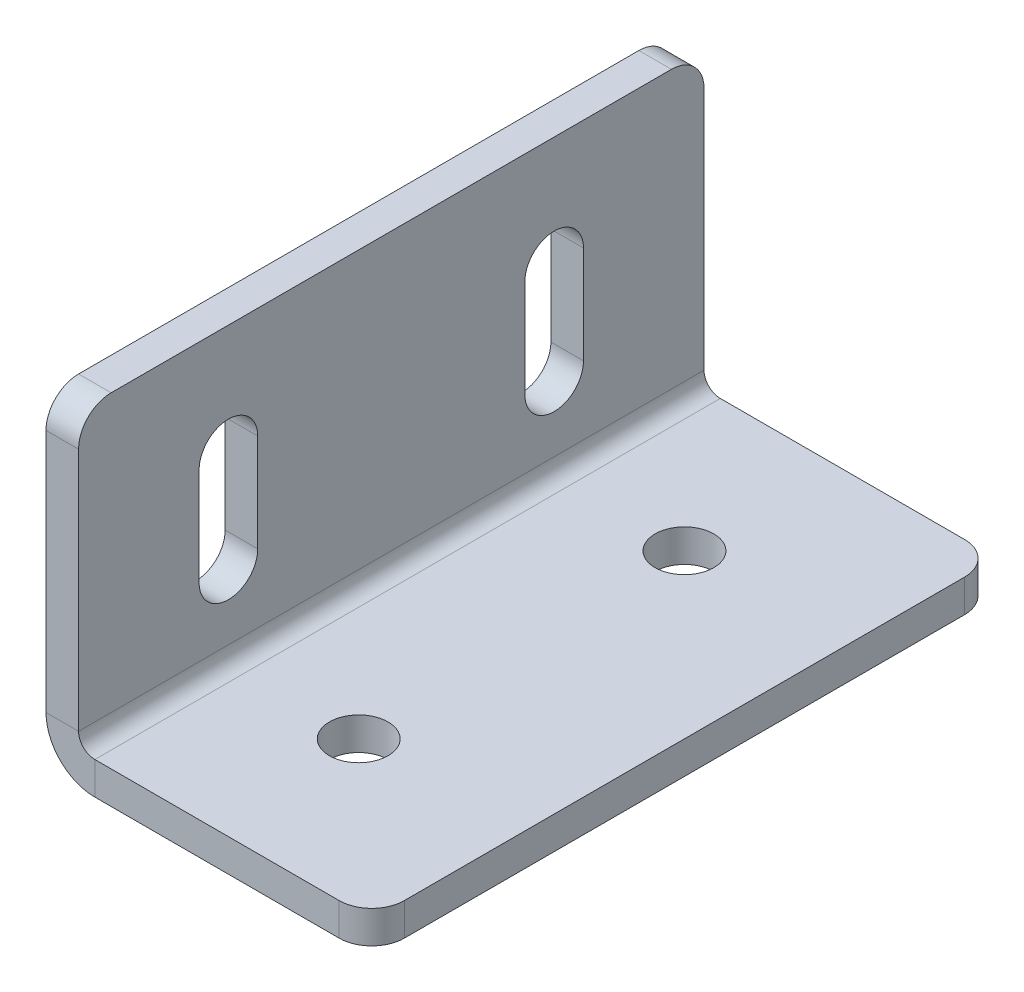
ISO-10303-21;
HEADER;
FILE_DESCRIPTION(('STEP AP214'),'2;1');
FILE_NAME('part.step','',(''),(''),'','','');
FILE_SCHEMA(('AUTOMOTIVE_DESIGN { 1 0 10303 214 1 1 1 1 }'));
ENDSEC;
DATA;
#1=APPLICATION_CONTEXT('core data for automotive mechanical design processes');
#2=APPLICATION_PROTOCOL_DEFINITION('international standard','automotive_design',2000,#1);
#3=PRODUCT_CONTEXT('',#1,'mechanical');
#4=PRODUCT('Part','Part','',(#3));
#5=PRODUCT_RELATED_PRODUCT_CATEGORY('part','',(#4));
#6=PRODUCT_DEFINITION_FORMATION('','',#4);
#7=PRODUCT_DEFINITION_CONTEXT('part definition',#1,'design');
#8=PRODUCT_DEFINITION('design','',#6,#7);
#9=PRODUCT_DEFINITION_SHAPE('','',#8);
#10=(LENGTH_UNIT() NAMED_UNIT(*) SI_UNIT(.MILLI.,.METRE.));
#11=(NAMED_UNIT(*) PLANE_ANGLE_UNIT() SI_UNIT($,.RADIAN.));
#12=(NAMED_UNIT(*) SI_UNIT($,.STERADIAN.) SOLID_ANGLE_UNIT());
#13=UNCERTAINTY_MEASURE_WITH_UNIT(LENGTH_MEASURE(1.E-05),#10,'distance_accuracy_value','');
#14=(GEOMETRIC_REPRESENTATION_CONTEXT(3) GLOBAL_UNCERTAINTY_ASSIGNED_CONTEXT((#13)) GLOBAL_UNIT_ASSIGNED_CONTEXT((#10,
#11,#12)) REPRESENTATION_CONTEXT('',''));
#15=CARTESIAN_POINT('',(0.,0.,0.));
#16=DIRECTION('',(0.,0.,1.));
#17=DIRECTION('',(1.,0.,0.));
#18=AXIS2_PLACEMENT_3D('',#15,#16,#17);
#19=CARTESIAN_POINT('',(0.,18.,-25.));
#20=DIRECTION('',(-1.,0.,0.));
#21=DIRECTION('',(0.,0.,1.));
#22=AXIS2_PLACEMENT_3D('',#19,#20,#21);
#23=CYLINDRICAL_SURFACE('',#22,4.5);
#24=CARTESIAN_POINT('',(5.,18.,-25.));
#25=DIRECTION('',(1.,0.,0.));
#26=DIRECTION('',(0.,0.,-1.));
#27=AXIS2_PLACEMENT_3D('',#24,#25,#26);
#28=CIRCLE('',#27,4.5);
#29=CARTESIAN_POINT('',(5.,18.,-20.5));
#30=VERTEX_POINT('',#29);
#31=CARTESIAN_POINT('',(5.,18.,-29.5));
#32=VERTEX_POINT('',#31);
#33=EDGE_CURVE('E354',#30,#32,#28,.T.);
#34=ORIENTED_EDGE('',*,*,#33,.T.);
#35=DIRECTION('',(1.,0.,0.));
#36=VECTOR('',#35,1.);
#37=CARTESIAN_POINT('',(0.,18.,-29.5));
#38=LINE('',#37,#36);
#39=CARTESIAN_POINT('',(0.,18.,-29.5));
#40=VERTEX_POINT('',#39);
#41=EDGE_CURVE('E258',#40,#32,#38,.T.);
#42=ORIENTED_EDGE('',*,*,#41,.F.);
#43=CARTESIAN_POINT('',(0.,18.,-25.));
#44=DIRECTION('',(1.,0.,0.));
#45=DIRECTION('',(0.,0.,-1.));
#46=AXIS2_PLACEMENT_3D('',#43,#44,#45);
#47=CIRCLE('',#46,4.5);
#48=CARTESIAN_POINT('',(0.,18.,-20.5));
#49=VERTEX_POINT('',#48);
#50=EDGE_CURVE('E267',#49,#40,#47,.T.);
#51=ORIENTED_EDGE('',*,*,#50,.F.);
#52=DIRECTION('',(1.,0.,0.));
#53=VECTOR('',#52,1.);
#54=CARTESIAN_POINT('',(0.,18.,-20.5));
#55=LINE('',#54,#53);
#56=EDGE_CURVE('E261',#49,#30,#55,.T.);
#57=ORIENTED_EDGE('',*,*,#56,.T.);
#58=EDGE_LOOP('',(#34,#42,#51,#57));
#59=FACE_BOUND('',#58,.T.);
#60=ADVANCED_FACE('F49',(#59),#23,.F.);
#61=CARTESIAN_POINT('',(0.,18.,25.));
#62=DIRECTION('',(-1.,0.,0.));
#63=DIRECTION('',(0.,0.,1.));
#64=AXIS2_PLACEMENT_3D('',#61,#62,#63);
#65=CYLINDRICAL_SURFACE('',#64,4.5);
#66=CARTESIAN_POINT('',(5.,18.,25.));
#67=DIRECTION('',(1.,0.,0.));
#68=DIRECTION('',(0.,0.,-1.));
#69=AXIS2_PLACEMENT_3D('',#66,#67,#68);
#70=CIRCLE('',#69,4.5);
#71=CARTESIAN_POINT('',(5.,18.,29.5));
#72=VERTEX_POINT('',#71);
#73=CARTESIAN_POINT('',(5.,18.,20.5));
#74=VERTEX_POINT('',#73);
#75=EDGE_CURVE('E364',#72,#74,#70,.T.);
#76=ORIENTED_EDGE('',*,*,#75,.T.);
#77=DIRECTION('',(1.,0.,0.));
#78=VECTOR('',#77,1.);
#79=CARTESIAN_POINT('',(0.,18.,20.5));
#80=LINE('',#79,#78);
#81=CARTESIAN_POINT('',(0.,18.,20.5));
#82=VERTEX_POINT('',#81);
#83=EDGE_CURVE('E229',#82,#74,#80,.T.);
#84=ORIENTED_EDGE('',*,*,#83,.F.);
#85=CARTESIAN_POINT('',(0.,18.,25.));
#86=DIRECTION('',(1.,0.,0.));
#87=DIRECTION('',(0.,0.,-1.));
#88=AXIS2_PLACEMENT_3D('',#85,#86,#87);
#89=CIRCLE('',#88,4.5);
#90=CARTESIAN_POINT('',(0.,18.,29.5));
#91=VERTEX_POINT('',#90);
#92=EDGE_CURVE('E271',#91,#82,#89,.T.);
#93=ORIENTED_EDGE('',*,*,#92,.F.);
#94=DIRECTION('',(1.,0.,0.));
#95=VECTOR('',#94,1.);
#96=CARTESIAN_POINT('',(0.,18.,29.5));
#97=LINE('',#96,#95);
#98=EDGE_CURVE('E194',#91,#72,#97,.T.);
#99=ORIENTED_EDGE('',*,*,#98,.T.);
#100=EDGE_LOOP('',(#76,#84,#93,#99));
#101=FACE_BOUND('',#100,.T.);
#102=ADVANCED_FACE('F510',(#101),#65,.F.);
#103=CARTESIAN_POINT('',(0.,0.,48.));
#104=DIRECTION('',(0.,0.,-1.));
#105=DIRECTION('',(0.,-1.,0.));
#106=AXIS2_PLACEMENT_3D('',#103,#104,#105);
#107=PLANE('',#106);
#108=DIRECTION('',(0.,1.,0.));
#109=VECTOR('',#108,1.);
#110=CARTESIAN_POINT('',(5.,0.,48.));
#111=LINE('',#110,#109);
#112=CARTESIAN_POINT('',(5.,45.,48.));
#113=VERTEX_POINT('',#112);
#114=CARTESIAN_POINT('',(5.,7.5,48.));
#115=VERTEX_POINT('',#114);
#116=EDGE_CURVE('E361',#113,#115,#111,.F.);
#117=ORIENTED_EDGE('',*,*,#116,.F.);
#118=DIRECTION('',(1.,0.,0.));
#119=VECTOR('',#118,1.);
#120=CARTESIAN_POINT('',(0.,45.,48.));
#121=LINE('',#120,#119);
#122=CARTESIAN_POINT('',(0.,45.,48.));
#123=VERTEX_POINT('',#122);
#124=EDGE_CURVE('E11',#113,#123,#121,.F.);
#125=ORIENTED_EDGE('',*,*,#124,.T.);
#126=DIRECTION('',(0.,-1.,0.));
#127=VECTOR('',#126,1.);
#128=CARTESIAN_POINT('',(0.,0.,48.));
#129=LINE('',#128,#127);
#130=CARTESIAN_POINT('',(0.,7.5,48.));
#131=VERTEX_POINT('',#130);
#132=EDGE_CURVE('E275',#123,#131,#129,.T.);
#133=ORIENTED_EDGE('',*,*,#132,.T.);
#134=DIRECTION('',(-1.,0.,0.));
#135=VECTOR('',#134,1.);
#136=CARTESIAN_POINT('',(0.,7.5,48.));
#137=LINE('',#136,#135);
#138=EDGE_CURVE('E381',#115,#131,#137,.T.);
#139=ORIENTED_EDGE('',*,*,#138,.F.);
#140=EDGE_LOOP('',(#117,#125,#133,#139));
#141=FACE_BOUND('',#140,.T.);
#142=ADVANCED_FACE('F467',(#141),#107,.F.);
#143=CARTESIAN_POINT('',(0.,50.,-48.));
#144=DIRECTION('',(0.,-1.,0.));
#145=DIRECTION('',(0.,0.,1.));
#146=AXIS2_PLACEMENT_3D('',#143,#144,#145);
#147=PLANE('',#146);
#148=DIRECTION('',(0.,0.,1.));
#149=VECTOR('',#148,1.);
#150=CARTESIAN_POINT('',(5.,50.,-48.));
#151=LINE('',#150,#149);
#152=CARTESIAN_POINT('',(5.,50.,-43.));
#153=VERTEX_POINT('',#152);
#154=CARTESIAN_POINT('',(5.,50.,43.));
#155=VERTEX_POINT('',#154);
#156=EDGE_CURVE('E357',#153,#155,#151,.T.);
#157=ORIENTED_EDGE('',*,*,#156,.F.);
#158=DIRECTION('',(-1.,0.,0.));
#159=VECTOR('',#158,1.);
#160=CARTESIAN_POINT('',(0.,50.,-43.));
#161=LINE('',#160,#159);
#162=CARTESIAN_POINT('',(0.,50.,-43.));
#163=VERTEX_POINT('',#162);
#164=EDGE_CURVE('E416',#153,#163,#161,.T.);
#165=ORIENTED_EDGE('',*,*,#164,.T.);
#166=DIRECTION('',(0.,0.,1.));
#167=VECTOR('',#166,1.);
#168=CARTESIAN_POINT('',(0.,50.,-48.));
#169=LINE('',#168,#167);
#170=CARTESIAN_POINT('',(0.,50.,43.));
#171=VERTEX_POINT('',#170);
#172=EDGE_CURVE('E278',#163,#171,#169,.T.);
#173=ORIENTED_EDGE('',*,*,#172,.T.);
#174=DIRECTION('',(1.,0.,0.));
#175=VECTOR('',#174,1.);
#176=CARTESIAN_POINT('',(0.,50.,43.));
#177=LINE('',#176,#175);
#178=EDGE_CURVE('E413',#171,#155,#177,.T.);
#179=ORIENTED_EDGE('',*,*,#178,.T.);
#180=EDGE_LOOP('',(#157,#165,#173,#179));
#181=FACE_BOUND('',#180,.T.);
#182=ADVANCED_FACE('F445',(#181),#147,.F.);
#183=CARTESIAN_POINT('',(0.,0.,-48.));
#184=DIRECTION('',(0.,0.,-1.));
#185=DIRECTION('',(0.,-1.,0.));
#186=AXIS2_PLACEMENT_3D('',#183,#184,#185);
#187=PLANE('',#186);
#188=DIRECTION('',(0.,-1.,0.));
#189=VECTOR('',#188,1.);
#190=CARTESIAN_POINT('',(0.,0.,-48.));
#191=LINE('',#190,#189);
#192=CARTESIAN_POINT('',(0.,45.,-48.));
#193=VERTEX_POINT('',#192);
#194=CARTESIAN_POINT('',(0.,7.5,-48.));
#195=VERTEX_POINT('',#194);
#196=EDGE_CURVE('E282',#193,#195,#191,.T.);
#197=ORIENTED_EDGE('',*,*,#196,.F.);
#198=DIRECTION('',(1.,0.,0.));
#199=VECTOR('',#198,1.);
#200=CARTESIAN_POINT('',(0.,45.,-48.));
#201=LINE('',#200,#199);
#202=CARTESIAN_POINT('',(5.,45.,-48.));
#203=VERTEX_POINT('',#202);
#204=EDGE_CURVE('E426',#193,#203,#201,.T.);
#205=ORIENTED_EDGE('',*,*,#204,.T.);
#206=DIRECTION('',(0.,1.,0.));
#207=VECTOR('',#206,1.);
#208=CARTESIAN_POINT('',(5.,0.,-48.));
#209=LINE('',#208,#207);
#210=CARTESIAN_POINT('',(5.,7.5,-48.));
#211=VERTEX_POINT('',#210);
#212=EDGE_CURVE('E335',#203,#211,#209,.F.);
#213=ORIENTED_EDGE('',*,*,#212,.T.);
#214=DIRECTION('',(-1.,0.,0.));
#215=VECTOR('',#214,1.);
#216=CARTESIAN_POINT('',(0.,7.5,-48.));
#217=LINE('',#216,#215);
#218=EDGE_CURVE('E377',#211,#195,#217,.T.);
#219=ORIENTED_EDGE('',*,*,#218,.T.);
#220=EDGE_LOOP('',(#197,#205,#213,#219));
#221=FACE_BOUND('',#220,.T.);
#222=ADVANCED_FACE('F452',(#221),#187,.T.);
#223=CARTESIAN_POINT('',(7.5,7.5,-48.));
#224=DIRECTION('',(0.,0.,1.));
#225=DIRECTION('',(1.,0.,0.));
#226=AXIS2_PLACEMENT_3D('',#223,#224,#225);
#227=PLANE('',#226);
#228=ORIENTED_EDGE('',*,*,#218,.F.);
#229=CARTESIAN_POINT('',(7.5,7.5,-48.));
#230=DIRECTION('',(0.,0.,1.));
#231=DIRECTION('',(1.,0.,0.));
#232=AXIS2_PLACEMENT_3D('',#229,#230,#231);
#233=CIRCLE('',#232,2.5);
#234=CARTESIAN_POINT('',(7.5,5.,-48.));
#235=VERTEX_POINT('',#234);
#236=EDGE_CURVE('E350',#211,#235,#233,.T.);
#237=ORIENTED_EDGE('',*,*,#236,.T.);
#238=DIRECTION('',(0.,-1.,0.));
#239=VECTOR('',#238,1.);
#240=CARTESIAN_POINT('',(7.5,0.,-48.));
#241=LINE('',#240,#239);
#242=CARTESIAN_POINT('',(7.5,0.,-48.));
#243=VERTEX_POINT('',#242);
#244=EDGE_CURVE('E374',#235,#243,#241,.T.);
#245=ORIENTED_EDGE('',*,*,#244,.T.);
#246=CARTESIAN_POINT('',(7.5,7.5,-48.));
#247=DIRECTION('',(0.,0.,-1.));
#248=DIRECTION('',(-1.,0.,0.));
#249=AXIS2_PLACEMENT_3D('',#246,#247,#248);
#250=CIRCLE('',#249,7.5);
#251=EDGE_CURVE('E272',#195,#243,#250,.F.);
#252=ORIENTED_EDGE('',*,*,#251,.F.);
#253=EDGE_LOOP('',(#228,#237,#245,#252));
#254=FACE_BOUND('',#253,.T.);
#255=ADVANCED_FACE('F457',(#254),#227,.F.);
#256=CARTESIAN_POINT('',(50.,0.,-48.));
#257=DIRECTION('',(0.,0.,-1.));
#258=DIRECTION('',(1.,0.,0.));
#259=AXIS2_PLACEMENT_3D('',#256,#257,#258);
#260=PLANE('',#259);
#261=DIRECTION('',(1.,0.,0.));
#262=VECTOR('',#261,1.);
#263=CARTESIAN_POINT('',(50.,5.,-48.));
#264=LINE('',#263,#262);
#265=CARTESIAN_POINT('',(45.,5.,-48.));
#266=VERTEX_POINT('',#265);
#267=EDGE_CURVE('E329',#235,#266,#264,.T.);
#268=ORIENTED_EDGE('',*,*,#267,.T.);
#269=DIRECTION('',(0.,-1.,0.));
#270=VECTOR('',#269,1.);
#271=CARTESIAN_POINT('',(45.,0.,-48.));
#272=LINE('',#271,#270);
#273=CARTESIAN_POINT('',(45.,0.,-48.));
#274=VERTEX_POINT('',#273);
#275=EDGE_CURVE('E385',#266,#274,#272,.T.);
#276=ORIENTED_EDGE('',*,*,#275,.T.);
#277=DIRECTION('',(1.,0.,0.));
#278=VECTOR('',#277,1.);
#279=CARTESIAN_POINT('',(50.,0.,-48.));
#280=LINE('',#279,#278);
#281=EDGE_CURVE('E301',#243,#274,#280,.T.);
#282=ORIENTED_EDGE('',*,*,#281,.F.);
#283=ORIENTED_EDGE('',*,*,#244,.F.);
#284=EDGE_LOOP('',(#268,#276,#282,#283));
#285=FACE_BOUND('',#284,.T.);
#286=ADVANCED_FACE('F500',(#285),#260,.T.);
#287=CARTESIAN_POINT('',(50.,0.,-48.));
#288=DIRECTION('',(1.,0.,0.));
#289=DIRECTION('',(0.,0.,1.));
#290=AXIS2_PLACEMENT_3D('',#287,#288,#289);
#291=PLANE('',#290);
#292=DIRECTION('',(0.,0.,1.));
#293=VECTOR('',#292,1.);
#294=CARTESIAN_POINT('',(50.,0.,-48.));
#295=LINE('',#294,#293);
#296=CARTESIAN_POINT('',(50.,0.,-43.));
#297=VERTEX_POINT('',#296);
#298=CARTESIAN_POINT('',(50.,0.,43.));
#299=VERTEX_POINT('',#298);
#300=EDGE_CURVE('E293',#297,#299,#295,.T.);
#301=ORIENTED_EDGE('',*,*,#300,.F.);
#302=DIRECTION('',(0.,-1.,0.));
#303=VECTOR('',#302,1.);
#304=CARTESIAN_POINT('',(50.,0.,-43.));
#305=LINE('',#304,#303);
#306=CARTESIAN_POINT('',(50.,5.,-43.));
#307=VERTEX_POINT('',#306);
#308=EDGE_CURVE('E401',#297,#307,#305,.F.);
#309=ORIENTED_EDGE('',*,*,#308,.T.);
#310=DIRECTION('',(0.,0.,1.));
#311=VECTOR('',#310,1.);
#312=CARTESIAN_POINT('',(50.,5.,-48.));
#313=LINE('',#312,#311);
#314=CARTESIAN_POINT('',(50.,5.,43.));
#315=VERTEX_POINT('',#314);
#316=EDGE_CURVE('E339',#307,#315,#313,.T.);
#317=ORIENTED_EDGE('',*,*,#316,.T.);
#318=DIRECTION('',(0.,1.,0.));
#319=VECTOR('',#318,1.);
#320=CARTESIAN_POINT('',(50.,0.,43.));
#321=LINE('',#320,#319);
#322=EDGE_CURVE('E397',#315,#299,#321,.F.);
#323=ORIENTED_EDGE('',*,*,#322,.T.);
#324=EDGE_LOOP('',(#301,#309,#317,#323));
#325=FACE_BOUND('',#324,.T.);
#326=ADVANCED_FACE('F491',(#325),#291,.T.);
#327=CARTESIAN_POINT('',(50.,0.,48.));
#328=DIRECTION('',(0.,0.,-1.));
#329=DIRECTION('',(1.,0.,0.));
#330=AXIS2_PLACEMENT_3D('',#327,#328,#329);
#331=PLANE('',#330);
#332=DIRECTION('',(1.,0.,0.));
#333=VECTOR('',#332,1.);
#334=CARTESIAN_POINT('',(50.,0.,48.));
#335=LINE('',#334,#333);
#336=CARTESIAN_POINT('',(7.5,0.,48.));
#337=VERTEX_POINT('',#336);
#338=CARTESIAN_POINT('',(45.,0.,48.));
#339=VERTEX_POINT('',#338);
#340=EDGE_CURVE('E297',#337,#339,#335,.T.);
#341=ORIENTED_EDGE('',*,*,#340,.T.);
#342=DIRECTION('',(0.,-1.,0.));
#343=VECTOR('',#342,1.);
#344=CARTESIAN_POINT('',(45.,0.,48.));
#345=LINE('',#344,#343);
#346=CARTESIAN_POINT('',(45.,5.,48.));
#347=VERTEX_POINT('',#346);
#348=EDGE_CURVE('E410',#339,#347,#345,.F.);
#349=ORIENTED_EDGE('',*,*,#348,.T.);
#350=DIRECTION('',(1.,0.,0.));
#351=VECTOR('',#350,1.);
#352=CARTESIAN_POINT('',(50.,5.,48.));
#353=LINE('',#352,#351);
#354=CARTESIAN_POINT('',(7.5,5.,48.));
#355=VERTEX_POINT('',#354);
#356=EDGE_CURVE('E340',#355,#347,#353,.T.);
#357=ORIENTED_EDGE('',*,*,#356,.F.);
#358=DIRECTION('',(0.,-1.,0.));
#359=VECTOR('',#358,1.);
#360=CARTESIAN_POINT('',(7.5,0.,48.));
#361=LINE('',#360,#359);
#362=EDGE_CURVE('E313',#355,#337,#361,.T.);
#363=ORIENTED_EDGE('',*,*,#362,.T.);
#364=EDGE_LOOP('',(#341,#349,#357,#363));
#365=FACE_BOUND('',#364,.T.);
#366=ADVANCED_FACE('F478',(#365),#331,.F.);
#367=CARTESIAN_POINT('',(25.,0.,-25.));
#368=DIRECTION('',(0.,-1.,0.));
#369=DIRECTION('',(1.,0.,0.));
#370=AXIS2_PLACEMENT_3D('',#367,#368,#369);
#371=CYLINDRICAL_SURFACE('',#370,4.49999999999999);
#372=CARTESIAN_POINT('',(25.,0.,-25.));
#373=DIRECTION('',(0.,-1.,0.));
#374=DIRECTION('',(0.,0.,-1.));
#375=AXIS2_PLACEMENT_3D('',#372,#373,#374);
#376=CIRCLE('',#375,4.49999999999999);
#377=CARTESIAN_POINT('',(25.,0.,-29.5));
#378=VERTEX_POINT('',#377);
#379=EDGE_CURVE('E285',#378,#378,#376,.T.);
#380=ORIENTED_EDGE('',*,*,#379,.T.);
#381=EDGE_LOOP('',(#380));
#382=FACE_BOUND('',#381,.T.);
#383=CARTESIAN_POINT('',(25.,5.,-25.));
#384=DIRECTION('',(0.,-1.,0.));
#385=DIRECTION('',(0.,0.,-1.));
#386=AXIS2_PLACEMENT_3D('',#383,#384,#385);
#387=CIRCLE('',#386,4.49999999999999);
#388=CARTESIAN_POINT('',(25.,5.,-29.5));
#389=VERTEX_POINT('',#388);
#390=EDGE_CURVE('E330',#389,#389,#387,.T.);
#391=ORIENTED_EDGE('',*,*,#390,.F.);
#392=EDGE_LOOP('',(#391));
#393=FACE_BOUND('',#392,.T.);
#394=ADVANCED_FACE('F558',(#382,#393),#371,.F.);
#395=CARTESIAN_POINT('',(25.,0.,25.));
#396=DIRECTION('',(0.,-1.,0.));
#397=DIRECTION('',(1.,0.,0.));
#398=AXIS2_PLACEMENT_3D('',#395,#396,#397);
#399=CYLINDRICAL_SURFACE('',#398,4.49999999999999);
#400=CARTESIAN_POINT('',(25.,0.,25.));
#401=DIRECTION('',(0.,-1.,0.));
#402=DIRECTION('',(0.,0.,-1.));
#403=AXIS2_PLACEMENT_3D('',#400,#401,#402);
#404=CIRCLE('',#403,4.49999999999999);
#405=CARTESIAN_POINT('',(25.,0.,20.5));
#406=VERTEX_POINT('',#405);
#407=EDGE_CURVE('E289',#406,#406,#404,.T.);
#408=ORIENTED_EDGE('',*,*,#407,.T.);
#409=EDGE_LOOP('',(#408));
#410=FACE_BOUND('',#409,.T.);
#411=CARTESIAN_POINT('',(25.,5.,25.));
#412=DIRECTION('',(0.,-1.,0.));
#413=DIRECTION('',(0.,0.,-1.));
#414=AXIS2_PLACEMENT_3D('',#411,#412,#413);
#415=CIRCLE('',#414,4.49999999999999);
#416=CARTESIAN_POINT('',(25.,5.,20.5));
#417=VERTEX_POINT('',#416);
#418=EDGE_CURVE('E334',#417,#417,#415,.T.);
#419=ORIENTED_EDGE('',*,*,#418,.F.);
#420=EDGE_LOOP('',(#419));
#421=FACE_BOUND('',#420,.T.);
#422=ADVANCED_FACE('F561',(#410,#421),#399,.F.);
#423=CARTESIAN_POINT('',(7.5,7.5,48.));
#424=DIRECTION('',(0.,0.,-1.));
#425=DIRECTION('',(-1.,0.,0.));
#426=AXIS2_PLACEMENT_3D('',#423,#424,#425);
#427=PLANE('',#426);
#428=CARTESIAN_POINT('',(7.5,7.5,48.));
#429=DIRECTION('',(0.,0.,1.));
#430=DIRECTION('',(1.,0.,0.));
#431=AXIS2_PLACEMENT_3D('',#428,#429,#430);
#432=CIRCLE('',#431,2.5);
#433=EDGE_CURVE('E228',#355,#115,#432,.F.);
#434=ORIENTED_EDGE('',*,*,#433,.T.);
#435=ORIENTED_EDGE('',*,*,#138,.T.);
#436=CARTESIAN_POINT('',(7.5,7.5,48.));
#437=DIRECTION('',(0.,0.,1.));
#438=DIRECTION('',(1.,0.,0.));
#439=AXIS2_PLACEMENT_3D('',#436,#437,#438);
#440=CIRCLE('',#439,7.5);
#441=EDGE_CURVE('E314',#337,#131,#440,.F.);
#442=ORIENTED_EDGE('',*,*,#441,.F.);
#443=ORIENTED_EDGE('',*,*,#362,.F.);
#444=EDGE_LOOP('',(#434,#435,#442,#443));
#445=FACE_BOUND('',#444,.T.);
#446=ADVANCED_FACE('F470',(#445),#427,.F.);
#447=CARTESIAN_POINT('',(50.,0.,-48.));
#448=DIRECTION('',(0.,-1.,0.));
#449=DIRECTION('',(1.,0.,0.));
#450=AXIS2_PLACEMENT_3D('',#447,#448,#449);
#451=PLANE('',#450);
#452=ORIENTED_EDGE('',*,*,#379,.F.);
#453=EDGE_LOOP('',(#452));
#454=FACE_BOUND('',#453,.T.);
#455=ORIENTED_EDGE('',*,*,#407,.F.);
#456=EDGE_LOOP('',(#455));
#457=FACE_BOUND('',#456,.T.);
#458=ORIENTED_EDGE('',*,*,#281,.T.);
#459=CARTESIAN_POINT('',(45.,0.,-43.));
#460=DIRECTION('',(0.,-1.,0.));
#461=DIRECTION('',(1.,0.,0.));
#462=AXIS2_PLACEMENT_3D('',#459,#460,#461);
#463=CIRCLE('',#462,5.);
#464=EDGE_CURVE('E394',#274,#297,#463,.T.);
#465=ORIENTED_EDGE('',*,*,#464,.T.);
#466=ORIENTED_EDGE('',*,*,#300,.T.);
#467=CARTESIAN_POINT('',(45.,0.,43.));
#468=DIRECTION('',(0.,-1.,0.));
#469=DIRECTION('',(1.,0.,0.));
#470=AXIS2_PLACEMENT_3D('',#467,#468,#469);
#471=CIRCLE('',#470,5.);
#472=EDGE_CURVE('E391',#299,#339,#471,.T.);
#473=ORIENTED_EDGE('',*,*,#472,.T.);
#474=ORIENTED_EDGE('',*,*,#340,.F.);
#475=DIRECTION('',(0.,0.,1.));
#476=VECTOR('',#475,1.);
#477=CARTESIAN_POINT('',(7.5,0.,-48.));
#478=LINE('',#477,#476);
#479=EDGE_CURVE('E309',#337,#243,#478,.F.);
#480=ORIENTED_EDGE('',*,*,#479,.T.);
#481=EDGE_LOOP('',(#458,#465,#466,#473,#474,#480));
#482=FACE_BOUND('',#481,.T.);
#483=ADVANCED_FACE('F494',(#454,#457,#482),#451,.T.);
#484=CARTESIAN_POINT('',(0.,0.,-48.));
#485=DIRECTION('',(-1.,0.,0.));
#486=DIRECTION('',(0.,0.,1.));
#487=AXIS2_PLACEMENT_3D('',#484,#485,#486);
#488=PLANE('',#487);
#489=DIRECTION('',(0.,1.,0.));
#490=VECTOR('',#489,1.);
#491=CARTESIAN_POINT('',(0.,33.,20.5));
#492=LINE('',#491,#490);
#493=CARTESIAN_POINT('',(0.,33.,20.5));
#494=VERTEX_POINT('',#493);
#495=EDGE_CURVE('E195',#82,#494,#492,.T.);
#496=ORIENTED_EDGE('',*,*,#495,.T.);
#497=CARTESIAN_POINT('',(0.,33.,25.));
#498=DIRECTION('',(1.,0.,0.));
#499=DIRECTION('',(0.,0.,-1.));
#500=AXIS2_PLACEMENT_3D('',#497,#498,#499);
#501=CIRCLE('',#500,4.5);
#502=CARTESIAN_POINT('',(0.,33.,29.5));
#503=VERTEX_POINT('',#502);
#504=EDGE_CURVE('E189',#494,#503,#501,.T.);
#505=ORIENTED_EDGE('',*,*,#504,.T.);
#506=DIRECTION('',(0.,-1.,0.));
#507=VECTOR('',#506,1.);
#508=CARTESIAN_POINT('',(0.,33.,29.5));
#509=LINE('',#508,#507);
#510=EDGE_CURVE('E198',#503,#91,#509,.T.);
#511=ORIENTED_EDGE('',*,*,#510,.T.);
#512=ORIENTED_EDGE('',*,*,#92,.T.);
#513=EDGE_LOOP('',(#496,#505,#511,#512));
#514=FACE_BOUND('',#513,.T.);
#515=DIRECTION('',(0.,1.,0.));
#516=VECTOR('',#515,1.);
#517=CARTESIAN_POINT('',(0.,33.,-29.5));
#518=LINE('',#517,#516);
#519=CARTESIAN_POINT('',(0.,33.,-29.5));
#520=VERTEX_POINT('',#519);
#521=EDGE_CURVE('E243',#40,#520,#518,.T.);
#522=ORIENTED_EDGE('',*,*,#521,.T.);
#523=CARTESIAN_POINT('',(0.,33.,-25.));
#524=DIRECTION('',(1.,0.,0.));
#525=DIRECTION('',(0.,0.,-1.));
#526=AXIS2_PLACEMENT_3D('',#523,#524,#525);
#527=CIRCLE('',#526,4.5);
#528=CARTESIAN_POINT('',(0.,33.,-20.5));
#529=VERTEX_POINT('',#528);
#530=EDGE_CURVE('E234',#520,#529,#527,.T.);
#531=ORIENTED_EDGE('',*,*,#530,.T.);
#532=DIRECTION('',(0.,-1.,0.));
#533=VECTOR('',#532,1.);
#534=CARTESIAN_POINT('',(0.,33.,-20.5));
#535=LINE('',#534,#533);
#536=EDGE_CURVE('E238',#529,#49,#535,.T.);
#537=ORIENTED_EDGE('',*,*,#536,.T.);
#538=ORIENTED_EDGE('',*,*,#50,.T.);
#539=EDGE_LOOP('',(#522,#531,#537,#538));
#540=FACE_BOUND('',#539,.T.);
#541=ORIENTED_EDGE('',*,*,#172,.F.);
#542=CARTESIAN_POINT('',(0.,45.,-43.));
#543=DIRECTION('',(-1.,0.,0.));
#544=DIRECTION('',(0.,0.,1.));
#545=AXIS2_PLACEMENT_3D('',#542,#543,#544);
#546=CIRCLE('',#545,5.);
#547=EDGE_CURVE('E423',#163,#193,#546,.T.);
#548=ORIENTED_EDGE('',*,*,#547,.T.);
#549=ORIENTED_EDGE('',*,*,#196,.T.);
#550=DIRECTION('',(0.,0.,1.));
#551=VECTOR('',#550,1.);
#552=CARTESIAN_POINT('',(0.,7.5,-48.));
#553=LINE('',#552,#551);
#554=EDGE_CURVE('E305',#195,#131,#553,.T.);
#555=ORIENTED_EDGE('',*,*,#554,.T.);
#556=ORIENTED_EDGE('',*,*,#132,.F.);
#557=CARTESIAN_POINT('',(0.,45.,43.));
#558=DIRECTION('',(-1.,0.,0.));
#559=DIRECTION('',(0.,0.,1.));
#560=AXIS2_PLACEMENT_3D('',#557,#558,#559);
#561=CIRCLE('',#560,5.);
#562=EDGE_CURVE('E420',#123,#171,#561,.T.);
#563=ORIENTED_EDGE('',*,*,#562,.T.);
#564=EDGE_LOOP('',(#541,#548,#549,#555,#556,#563));
#565=FACE_BOUND('',#564,.T.);
#566=ADVANCED_FACE('F206',(#514,#540,#565),#488,.T.);
#567=CARTESIAN_POINT('',(7.5,7.5,-48.));
#568=DIRECTION('',(0.,0.,1.));
#569=DIRECTION('',(1.,0.,0.));
#570=AXIS2_PLACEMENT_3D('',#567,#568,#569);
#571=CYLINDRICAL_SURFACE('',#570,7.5);
#572=ORIENTED_EDGE('',*,*,#251,.T.);
#573=ORIENTED_EDGE('',*,*,#479,.F.);
#574=ORIENTED_EDGE('',*,*,#441,.T.);
#575=ORIENTED_EDGE('',*,*,#554,.F.);
#576=EDGE_LOOP('',(#572,#573,#574,#575));
#577=FACE_BOUND('',#576,.T.);
#578=ADVANCED_FACE('F461',(#577),#571,.T.);
#579=CARTESIAN_POINT('',(50.,5.,-48.));
#580=DIRECTION('',(0.,-1.,0.));
#581=DIRECTION('',(1.,0.,0.));
#582=AXIS2_PLACEMENT_3D('',#579,#580,#581);
#583=PLANE('',#582);
#584=ORIENTED_EDGE('',*,*,#390,.T.);
#585=EDGE_LOOP('',(#584));
#586=FACE_BOUND('',#585,.T.);
#587=ORIENTED_EDGE('',*,*,#418,.T.);
#588=EDGE_LOOP('',(#587));
#589=FACE_BOUND('',#588,.T.);
#590=ORIENTED_EDGE('',*,*,#316,.F.);
#591=CARTESIAN_POINT('',(45.,5.,-43.));
#592=DIRECTION('',(0.,-1.,0.));
#593=DIRECTION('',(1.,0.,0.));
#594=AXIS2_PLACEMENT_3D('',#591,#592,#593);
#595=CIRCLE('',#594,5.);
#596=EDGE_CURVE('E407',#307,#266,#595,.F.);
#597=ORIENTED_EDGE('',*,*,#596,.T.);
#598=ORIENTED_EDGE('',*,*,#267,.F.);
#599=DIRECTION('',(0.,0.,1.));
#600=VECTOR('',#599,1.);
#601=CARTESIAN_POINT('',(7.5,5.,-48.));
#602=LINE('',#601,#600);
#603=EDGE_CURVE('E318',#355,#235,#602,.F.);
#604=ORIENTED_EDGE('',*,*,#603,.F.);
#605=ORIENTED_EDGE('',*,*,#356,.T.);
#606=CARTESIAN_POINT('',(45.,5.,43.));
#607=DIRECTION('',(0.,-1.,0.));
#608=DIRECTION('',(1.,0.,0.));
#609=AXIS2_PLACEMENT_3D('',#606,#607,#608);
#610=CIRCLE('',#609,5.);
#611=EDGE_CURVE('E404',#347,#315,#610,.F.);
#612=ORIENTED_EDGE('',*,*,#611,.T.);
#613=EDGE_LOOP('',(#590,#597,#598,#604,#605,#612));
#614=FACE_BOUND('',#613,.T.);
#615=ADVANCED_FACE('F484',(#586,#589,#614),#583,.F.);
#616=CARTESIAN_POINT('',(5.,0.,-48.));
#617=DIRECTION('',(-1.,0.,0.));
#618=DIRECTION('',(0.,0.,1.));
#619=AXIS2_PLACEMENT_3D('',#616,#617,#618);
#620=PLANE('',#619);
#621=CARTESIAN_POINT('',(5.,33.,-25.));
#622=DIRECTION('',(1.,0.,0.));
#623=DIRECTION('',(0.,0.,-1.));
#624=AXIS2_PLACEMENT_3D('',#621,#622,#623);
#625=CIRCLE('',#624,4.5);
#626=CARTESIAN_POINT('',(5.,33.,-29.5));
#627=VERTEX_POINT('',#626);
#628=CARTESIAN_POINT('',(5.,33.,-20.5));
#629=VERTEX_POINT('',#628);
#630=EDGE_CURVE('E73',#627,#629,#625,.T.);
#631=ORIENTED_EDGE('',*,*,#630,.F.);
#632=DIRECTION('',(0.,1.,0.));
#633=VECTOR('',#632,1.);
#634=CARTESIAN_POINT('',(5.,33.,-29.5));
#635=LINE('',#634,#633);
#636=EDGE_CURVE('E239',#32,#627,#635,.T.);
#637=ORIENTED_EDGE('',*,*,#636,.F.);
#638=ORIENTED_EDGE('',*,*,#33,.F.);
#639=DIRECTION('',(0.,-1.,0.));
#640=VECTOR('',#639,1.);
#641=CARTESIAN_POINT('',(5.,33.,-20.5));
#642=LINE('',#641,#640);
#643=EDGE_CURVE('E250',#629,#30,#642,.T.);
#644=ORIENTED_EDGE('',*,*,#643,.F.);
#645=EDGE_LOOP('',(#631,#637,#638,#644));
#646=FACE_BOUND('',#645,.T.);
#647=CARTESIAN_POINT('',(5.,33.,25.));
#648=DIRECTION('',(1.,0.,0.));
#649=DIRECTION('',(0.,0.,-1.));
#650=AXIS2_PLACEMENT_3D('',#647,#648,#649);
#651=CIRCLE('',#650,4.5);
#652=CARTESIAN_POINT('',(5.,33.,20.5));
#653=VERTEX_POINT('',#652);
#654=CARTESIAN_POINT('',(5.,33.,29.5));
#655=VERTEX_POINT('',#654);
#656=EDGE_CURVE('E65',#653,#655,#651,.T.);
#657=ORIENTED_EDGE('',*,*,#656,.F.);
#658=DIRECTION('',(0.,1.,0.));
#659=VECTOR('',#658,1.);
#660=CARTESIAN_POINT('',(5.,33.,20.5));
#661=LINE('',#660,#659);
#662=EDGE_CURVE('E209',#74,#653,#661,.T.);
#663=ORIENTED_EDGE('',*,*,#662,.F.);
#664=ORIENTED_EDGE('',*,*,#75,.F.);
#665=DIRECTION('',(0.,-1.,0.));
#666=VECTOR('',#665,1.);
#667=CARTESIAN_POINT('',(5.,33.,29.5));
#668=LINE('',#667,#666);
#669=EDGE_CURVE('E215',#655,#72,#668,.T.);
#670=ORIENTED_EDGE('',*,*,#669,.F.);
#671=EDGE_LOOP('',(#657,#663,#664,#670));
#672=FACE_BOUND('',#671,.T.);
#673=ORIENTED_EDGE('',*,*,#212,.F.);
#674=CARTESIAN_POINT('',(5.,45.,-43.));
#675=DIRECTION('',(-1.,0.,0.));
#676=DIRECTION('',(0.,0.,1.));
#677=AXIS2_PLACEMENT_3D('',#674,#675,#676);
#678=CIRCLE('',#677,5.);
#679=EDGE_CURVE('E58',#203,#153,#678,.F.);
#680=ORIENTED_EDGE('',*,*,#679,.T.);
#681=ORIENTED_EDGE('',*,*,#156,.T.);
#682=CARTESIAN_POINT('',(5.,45.,43.));
#683=DIRECTION('',(-1.,0.,0.));
#684=DIRECTION('',(0.,0.,1.));
#685=AXIS2_PLACEMENT_3D('',#682,#683,#684);
#686=CIRCLE('',#685,5.);
#687=EDGE_CURVE('E429',#155,#113,#686,.F.);
#688=ORIENTED_EDGE('',*,*,#687,.T.);
#689=ORIENTED_EDGE('',*,*,#116,.T.);
#690=DIRECTION('',(0.,0.,1.));
#691=VECTOR('',#690,1.);
#692=CARTESIAN_POINT('',(5.,7.5,-48.));
#693=LINE('',#692,#691);
#694=EDGE_CURVE('E325',#211,#115,#693,.T.);
#695=ORIENTED_EDGE('',*,*,#694,.F.);
#696=EDGE_LOOP('',(#673,#680,#681,#688,#689,#695));
#697=FACE_BOUND('',#696,.T.);
#698=ADVANCED_FACE('F438',(#646,#672,#697),#620,.F.);
#699=CARTESIAN_POINT('',(7.5,7.5,-48.));
#700=DIRECTION('',(0.,0.,1.));
#701=DIRECTION('',(1.,0.,0.));
#702=AXIS2_PLACEMENT_3D('',#699,#700,#701);
#703=CYLINDRICAL_SURFACE('',#702,2.5);
#704=ORIENTED_EDGE('',*,*,#236,.F.);
#705=ORIENTED_EDGE('',*,*,#694,.T.);
#706=ORIENTED_EDGE('',*,*,#433,.F.);
#707=ORIENTED_EDGE('',*,*,#603,.T.);
#708=EDGE_LOOP('',(#704,#705,#706,#707));
#709=FACE_BOUND('',#708,.T.);
#710=ADVANCED_FACE('F476',(#709),#703,.F.);
#711=CARTESIAN_POINT('',(45.,0.,-43.));
#712=DIRECTION('',(0.,-1.,0.));
#713=DIRECTION('',(1.,0.,0.));
#714=AXIS2_PLACEMENT_3D('',#711,#712,#713);
#715=CYLINDRICAL_SURFACE('',#714,5.);
#716=ORIENTED_EDGE('',*,*,#596,.F.);
#717=ORIENTED_EDGE('',*,*,#308,.F.);
#718=ORIENTED_EDGE('',*,*,#464,.F.);
#719=ORIENTED_EDGE('',*,*,#275,.F.);
#720=EDGE_LOOP('',(#716,#717,#718,#719));
#721=FACE_BOUND('',#720,.T.);
#722=ADVANCED_FACE('F498',(#721),#715,.T.);
#723=CARTESIAN_POINT('',(45.,0.,43.));
#724=DIRECTION('',(0.,1.,0.));
#725=DIRECTION('',(-1.,0.,0.));
#726=AXIS2_PLACEMENT_3D('',#723,#724,#725);
#727=CYLINDRICAL_SURFACE('',#726,5.);
#728=ORIENTED_EDGE('',*,*,#611,.F.);
#729=ORIENTED_EDGE('',*,*,#348,.F.);
#730=ORIENTED_EDGE('',*,*,#472,.F.);
#731=ORIENTED_EDGE('',*,*,#322,.F.);
#732=EDGE_LOOP('',(#728,#729,#730,#731));
#733=FACE_BOUND('',#732,.T.);
#734=ADVANCED_FACE('F488',(#733),#727,.T.);
#735=CARTESIAN_POINT('',(0.,45.,-43.));
#736=DIRECTION('',(1.,0.,0.));
#737=DIRECTION('',(0.,0.,-1.));
#738=AXIS2_PLACEMENT_3D('',#735,#736,#737);
#739=CYLINDRICAL_SURFACE('',#738,5.);
#740=ORIENTED_EDGE('',*,*,#679,.F.);
#741=ORIENTED_EDGE('',*,*,#204,.F.);
#742=ORIENTED_EDGE('',*,*,#547,.F.);
#743=ORIENTED_EDGE('',*,*,#164,.F.);
#744=EDGE_LOOP('',(#740,#741,#742,#743));
#745=FACE_BOUND('',#744,.T.);
#746=ADVANCED_FACE('F448',(#745),#739,.T.);
#747=CARTESIAN_POINT('',(0.,45.,43.));
#748=DIRECTION('',(-1.,0.,0.));
#749=DIRECTION('',(0.,0.,1.));
#750=AXIS2_PLACEMENT_3D('',#747,#748,#749);
#751=CYLINDRICAL_SURFACE('',#750,5.);
#752=ORIENTED_EDGE('',*,*,#687,.F.);
#753=ORIENTED_EDGE('',*,*,#178,.F.);
#754=ORIENTED_EDGE('',*,*,#562,.F.);
#755=ORIENTED_EDGE('',*,*,#124,.F.);
#756=EDGE_LOOP('',(#752,#753,#754,#755));
#757=FACE_BOUND('',#756,.T.);
#758=ADVANCED_FACE('F51',(#757),#751,.T.);
#759=CARTESIAN_POINT('',(0.,33.,-25.));
#760=DIRECTION('',(1.,0.,0.));
#761=DIRECTION('',(0.,0.,-1.));
#762=AXIS2_PLACEMENT_3D('',#759,#760,#761);
#763=CYLINDRICAL_SURFACE('',#762,4.5);
#764=ORIENTED_EDGE('',*,*,#630,.T.);
#765=DIRECTION('',(1.,0.,0.));
#766=VECTOR('',#765,1.);
#767=CARTESIAN_POINT('',(0.,33.,-20.5));
#768=LINE('',#767,#766);
#769=EDGE_CURVE('E247',#529,#629,#768,.T.);
#770=ORIENTED_EDGE('',*,*,#769,.F.);
#771=ORIENTED_EDGE('',*,*,#530,.F.);
#772=DIRECTION('',(1.,0.,0.));
#773=VECTOR('',#772,1.);
#774=CARTESIAN_POINT('',(0.,33.,-29.5));
#775=LINE('',#774,#773);
#776=EDGE_CURVE('E222',#520,#627,#775,.T.);
#777=ORIENTED_EDGE('',*,*,#776,.T.);
#778=EDGE_LOOP('',(#764,#770,#771,#777));
#779=FACE_BOUND('',#778,.T.);
#780=ADVANCED_FACE('F528',(#779),#763,.F.);
#781=CARTESIAN_POINT('',(0.,33.,-29.5));
#782=DIRECTION('',(0.,0.,-1.));
#783=DIRECTION('',(0.,1.,0.));
#784=AXIS2_PLACEMENT_3D('',#781,#782,#783);
#785=PLANE('',#784);
#786=ORIENTED_EDGE('',*,*,#636,.T.);
#787=ORIENTED_EDGE('',*,*,#776,.F.);
#788=ORIENTED_EDGE('',*,*,#521,.F.);
#789=ORIENTED_EDGE('',*,*,#41,.T.);
#790=EDGE_LOOP('',(#786,#787,#788,#789));
#791=FACE_BOUND('',#790,.T.);
#792=ADVANCED_FACE('F533',(#791),#785,.F.);
#793=CARTESIAN_POINT('',(0.,33.,-20.5));
#794=DIRECTION('',(0.,0.,1.));
#795=DIRECTION('',(0.,-1.,0.));
#796=AXIS2_PLACEMENT_3D('',#793,#794,#795);
#797=PLANE('',#796);
#798=ORIENTED_EDGE('',*,*,#643,.T.);
#799=ORIENTED_EDGE('',*,*,#56,.F.);
#800=ORIENTED_EDGE('',*,*,#536,.F.);
#801=ORIENTED_EDGE('',*,*,#769,.T.);
#802=EDGE_LOOP('',(#798,#799,#800,#801));
#803=FACE_BOUND('',#802,.T.);
#804=ADVANCED_FACE('F538',(#803),#797,.F.);
#805=CARTESIAN_POINT('',(0.,33.,25.));
#806=DIRECTION('',(1.,0.,0.));
#807=DIRECTION('',(0.,0.,-1.));
#808=AXIS2_PLACEMENT_3D('',#805,#806,#807);
#809=CYLINDRICAL_SURFACE('',#808,4.5);
#810=ORIENTED_EDGE('',*,*,#656,.T.);
#811=DIRECTION('',(1.,0.,0.));
#812=VECTOR('',#811,1.);
#813=CARTESIAN_POINT('',(0.,33.,29.5));
#814=LINE('',#813,#812);
#815=EDGE_CURVE('E185',#503,#655,#814,.T.);
#816=ORIENTED_EDGE('',*,*,#815,.F.);
#817=ORIENTED_EDGE('',*,*,#504,.F.);
#818=DIRECTION('',(1.,0.,0.));
#819=VECTOR('',#818,1.);
#820=CARTESIAN_POINT('',(0.,33.,20.5));
#821=LINE('',#820,#819);
#822=EDGE_CURVE('E225',#494,#653,#821,.T.);
#823=ORIENTED_EDGE('',*,*,#822,.T.);
#824=EDGE_LOOP('',(#810,#816,#817,#823));
#825=FACE_BOUND('',#824,.T.);
#826=ADVANCED_FACE('F187',(#825),#809,.F.);
#827=CARTESIAN_POINT('',(0.,33.,20.5));
#828=DIRECTION('',(0.,0.,-1.));
#829=DIRECTION('',(0.,1.,0.));
#830=AXIS2_PLACEMENT_3D('',#827,#828,#829);
#831=PLANE('',#830);
#832=ORIENTED_EDGE('',*,*,#662,.T.);
#833=ORIENTED_EDGE('',*,*,#822,.F.);
#834=ORIENTED_EDGE('',*,*,#495,.F.);
#835=ORIENTED_EDGE('',*,*,#83,.T.);
#836=EDGE_LOOP('',(#832,#833,#834,#835));
#837=FACE_BOUND('',#836,.T.);
#838=ADVANCED_FACE('F645',(#837),#831,.F.);
#839=CARTESIAN_POINT('',(0.,33.,29.5));
#840=DIRECTION('',(0.,0.,1.));
#841=DIRECTION('',(0.,-1.,0.));
#842=AXIS2_PLACEMENT_3D('',#839,#840,#841);
#843=PLANE('',#842);
#844=ORIENTED_EDGE('',*,*,#669,.T.);
#845=ORIENTED_EDGE('',*,*,#98,.F.);
#846=ORIENTED_EDGE('',*,*,#510,.F.);
#847=ORIENTED_EDGE('',*,*,#815,.T.);
#848=EDGE_LOOP('',(#844,#845,#846,#847));
#849=FACE_BOUND('',#848,.T.);
#850=ADVANCED_FACE('F199',(#849),#843,.F.);
#851=CLOSED_SHELL('',(#60,#102,#142,#182,#222,#255,#286,#326,#366,#394,#422,#446,#483,#566,#578,
#615,#698,#710,#722,#734,#746,#758,#780,#792,#804,#826,#838,#850));
#852=MANIFOLD_SOLID_BREP('B2',#851);
#853=ADVANCED_BREP_SHAPE_REPRESENTATION('',(#18,#852),#14);
#854=SHAPE_DEFINITION_REPRESENTATION(#9,#853);
ENDSEC;
END-ISO-10303-21;
